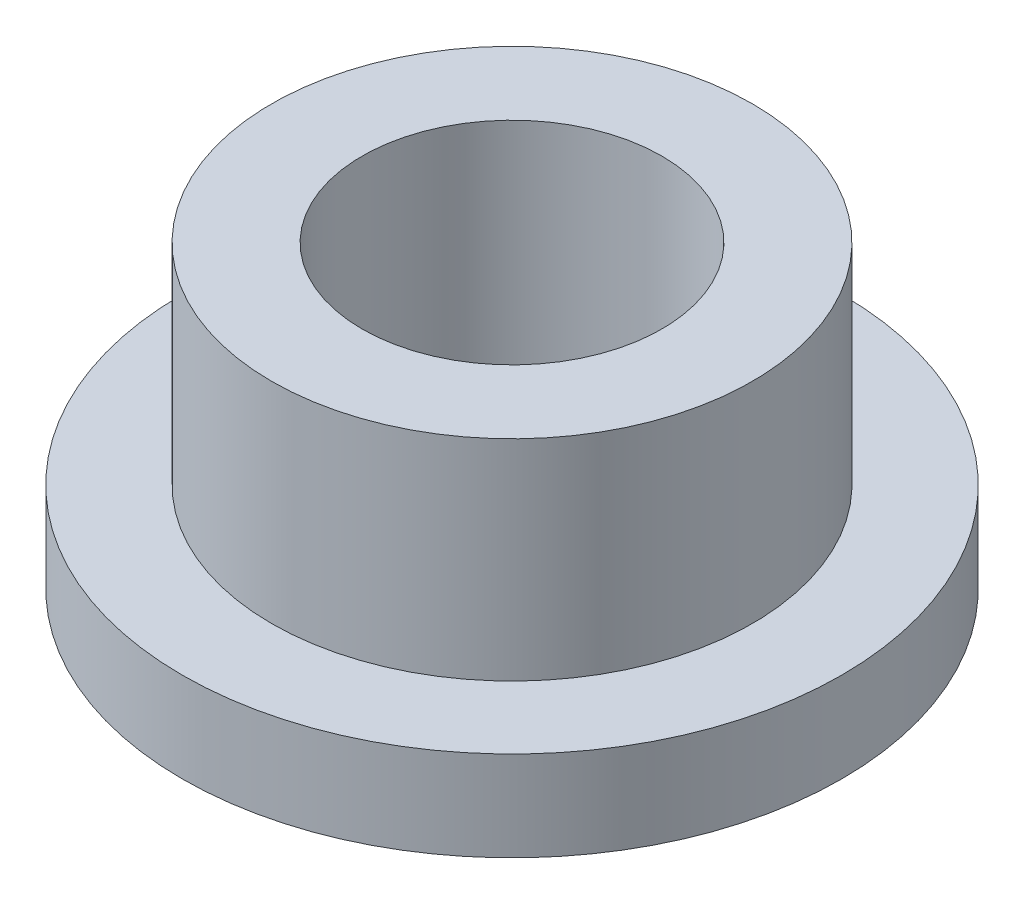
ISO-10303-21;
HEADER;
FILE_DESCRIPTION(('STEP AP214'),'2;1');
FILE_NAME('part.step','',(''),(''),'','','');
FILE_SCHEMA(('AUTOMOTIVE_DESIGN { 1 0 10303 214 1 1 1 1 }'));
ENDSEC;
DATA;
#1=APPLICATION_CONTEXT('core data for automotive mechanical design processes');
#2=APPLICATION_PROTOCOL_DEFINITION('international standard','automotive_design',2000,#1);
#3=PRODUCT_CONTEXT('',#1,'mechanical');
#4=PRODUCT('Part','Part','',(#3));
#5=PRODUCT_RELATED_PRODUCT_CATEGORY('part','',(#4));
#6=PRODUCT_DEFINITION_FORMATION('','',#4);
#7=PRODUCT_DEFINITION_CONTEXT('part definition',#1,'design');
#8=PRODUCT_DEFINITION('design','',#6,#7);
#9=PRODUCT_DEFINITION_SHAPE('','',#8);
#10=(LENGTH_UNIT() NAMED_UNIT(*) SI_UNIT(.MILLI.,.METRE.));
#11=(NAMED_UNIT(*) PLANE_ANGLE_UNIT() SI_UNIT($,.RADIAN.));
#12=(NAMED_UNIT(*) SI_UNIT($,.STERADIAN.) SOLID_ANGLE_UNIT());
#13=UNCERTAINTY_MEASURE_WITH_UNIT(LENGTH_MEASURE(1.E-05),#10,'distance_accuracy_value','');
#14=(GEOMETRIC_REPRESENTATION_CONTEXT(3) GLOBAL_UNCERTAINTY_ASSIGNED_CONTEXT((#13)) GLOBAL_UNIT_ASSIGNED_CONTEXT((#10,
#11,#12)) REPRESENTATION_CONTEXT('',''));
#15=CARTESIAN_POINT('',(0.,0.,0.));
#16=DIRECTION('',(0.,0.,1.));
#17=DIRECTION('',(1.,0.,0.));
#18=AXIS2_PLACEMENT_3D('',#15,#16,#17);
#19=CARTESIAN_POINT('',(0.,5.,0.));
#20=DIRECTION('',(0.,1.,0.));
#21=DIRECTION('',(0.,0.,1.));
#22=AXIS2_PLACEMENT_3D('',#19,#20,#21);
#23=PLANE('',#22);
#24=CARTESIAN_POINT('',(0.,5.,0.));
#25=DIRECTION('',(0.,1.,0.));
#26=DIRECTION('',(0.,0.,1.));
#27=AXIS2_PLACEMENT_3D('',#24,#25,#26);
#28=CIRCLE('',#27,4.01);
#29=CARTESIAN_POINT('',(0.,5.,4.01));
#30=VERTEX_POINT('',#29);
#31=EDGE_CURVE('E10',#30,#30,#28,.T.);
#32=ORIENTED_EDGE('',*,*,#31,.T.);
#33=EDGE_LOOP('',(#32));
#34=FACE_BOUND('',#33,.T.);
#35=CARTESIAN_POINT('',(0.,5.,0.));
#36=DIRECTION('',(0.,1.,0.));
#37=DIRECTION('',(0.,0.,1.));
#38=AXIS2_PLACEMENT_3D('',#35,#36,#37);
#39=CIRCLE('',#38,2.5);
#40=CARTESIAN_POINT('',(0.,5.,2.5));
#41=VERTEX_POINT('',#40);
#42=EDGE_CURVE('E40',#41,#41,#39,.T.);
#43=ORIENTED_EDGE('',*,*,#42,.F.);
#44=EDGE_LOOP('',(#43));
#45=FACE_BOUND('',#44,.T.);
#46=ADVANCED_FACE('F33',(#34,#45),#23,.T.);
#47=CARTESIAN_POINT('',(0.,0.,0.));
#48=DIRECTION('',(0.,1.,0.));
#49=DIRECTION('',(0.,0.,1.));
#50=AXIS2_PLACEMENT_3D('',#47,#48,#49);
#51=PLANE('',#50);
#52=CARTESIAN_POINT('',(0.,0.,0.));
#53=DIRECTION('',(0.,1.,0.));
#54=DIRECTION('',(0.,0.,1.));
#55=AXIS2_PLACEMENT_3D('',#52,#53,#54);
#56=CIRCLE('',#55,2.5);
#57=CARTESIAN_POINT('',(0.,0.,2.5));
#58=VERTEX_POINT('',#57);
#59=EDGE_CURVE('E44',#58,#58,#56,.T.);
#60=ORIENTED_EDGE('',*,*,#59,.T.);
#61=EDGE_LOOP('',(#60));
#62=FACE_BOUND('',#61,.T.);
#63=CARTESIAN_POINT('',(0.,0.,0.));
#64=DIRECTION('',(0.,1.,0.));
#65=DIRECTION('',(0.,0.,1.));
#66=AXIS2_PLACEMENT_3D('',#63,#64,#65);
#67=CIRCLE('',#66,5.5);
#68=CARTESIAN_POINT('',(0.,0.,5.5));
#69=VERTEX_POINT('',#68);
#70=EDGE_CURVE('E51',#69,#69,#67,.T.);
#71=ORIENTED_EDGE('',*,*,#70,.F.);
#72=EDGE_LOOP('',(#71));
#73=FACE_BOUND('',#72,.T.);
#74=ADVANCED_FACE('F76',(#62,#73),#51,.F.);
#75=CARTESIAN_POINT('',(0.,5.,0.));
#76=DIRECTION('',(0.,-1.,0.));
#77=DIRECTION('',(0.,0.,-1.));
#78=AXIS2_PLACEMENT_3D('',#75,#76,#77);
#79=CYLINDRICAL_SURFACE('',#78,4.01);
#80=CARTESIAN_POINT('',(0.,1.5,0.));
#81=DIRECTION('',(0.,1.,0.));
#82=DIRECTION('',(0.,0.,1.));
#83=AXIS2_PLACEMENT_3D('',#80,#81,#82);
#84=CIRCLE('',#83,4.01);
#85=CARTESIAN_POINT('',(0.,1.5,4.01));
#86=VERTEX_POINT('',#85);
#87=EDGE_CURVE('E54',#86,#86,#84,.T.);
#88=ORIENTED_EDGE('',*,*,#87,.T.);
#89=EDGE_LOOP('',(#88));
#90=FACE_BOUND('',#89,.T.);
#91=ORIENTED_EDGE('',*,*,#31,.F.);
#92=EDGE_LOOP('',(#91));
#93=FACE_BOUND('',#92,.T.);
#94=ADVANCED_FACE('F35',(#90,#93),#79,.T.);
#95=CARTESIAN_POINT('',(0.,5.,0.));
#96=DIRECTION('',(0.,-1.,0.));
#97=DIRECTION('',(0.,0.,-1.));
#98=AXIS2_PLACEMENT_3D('',#95,#96,#97);
#99=CYLINDRICAL_SURFACE('',#98,2.5);
#100=ORIENTED_EDGE('',*,*,#42,.T.);
#101=EDGE_LOOP('',(#100));
#102=FACE_BOUND('',#101,.T.);
#103=ORIENTED_EDGE('',*,*,#59,.F.);
#104=EDGE_LOOP('',(#103));
#105=FACE_BOUND('',#104,.T.);
#106=ADVANCED_FACE('F65',(#102,#105),#99,.F.);
#107=CARTESIAN_POINT('',(0.,1.5,0.));
#108=DIRECTION('',(0.,1.,0.));
#109=DIRECTION('',(0.,0.,1.));
#110=AXIS2_PLACEMENT_3D('',#107,#108,#109);
#111=PLANE('',#110);
#112=CARTESIAN_POINT('',(0.,1.5,0.));
#113=DIRECTION('',(0.,1.,0.));
#114=DIRECTION('',(0.,0.,1.));
#115=AXIS2_PLACEMENT_3D('',#112,#113,#114);
#116=CIRCLE('',#115,5.5);
#117=CARTESIAN_POINT('',(0.,1.5,5.5));
#118=VERTEX_POINT('',#117);
#119=EDGE_CURVE('E49',#118,#118,#116,.T.);
#120=ORIENTED_EDGE('',*,*,#119,.T.);
#121=EDGE_LOOP('',(#120));
#122=FACE_BOUND('',#121,.T.);
#123=ORIENTED_EDGE('',*,*,#87,.F.);
#124=EDGE_LOOP('',(#123));
#125=FACE_BOUND('',#124,.T.);
#126=ADVANCED_FACE('F62',(#122,#125),#111,.T.);
#127=CARTESIAN_POINT('',(0.,1.5,0.));
#128=DIRECTION('',(0.,-1.,0.));
#129=DIRECTION('',(0.,0.,-1.));
#130=AXIS2_PLACEMENT_3D('',#127,#128,#129);
#131=CYLINDRICAL_SURFACE('',#130,5.5);
#132=ORIENTED_EDGE('',*,*,#119,.F.);
#133=EDGE_LOOP('',(#132));
#134=FACE_BOUND('',#133,.T.);
#135=ORIENTED_EDGE('',*,*,#70,.T.);
#136=EDGE_LOOP('',(#135));
#137=FACE_BOUND('',#136,.T.);
#138=ADVANCED_FACE('F64',(#134,#137),#131,.T.);
#139=CLOSED_SHELL('',(#46,#74,#94,#106,#126,#138));
#140=MANIFOLD_SOLID_BREP('B2',#139);
#141=ADVANCED_BREP_SHAPE_REPRESENTATION('',(#18,#140),#14);
#142=SHAPE_DEFINITION_REPRESENTATION(#9,#141);
ENDSEC;
END-ISO-10303-21;
